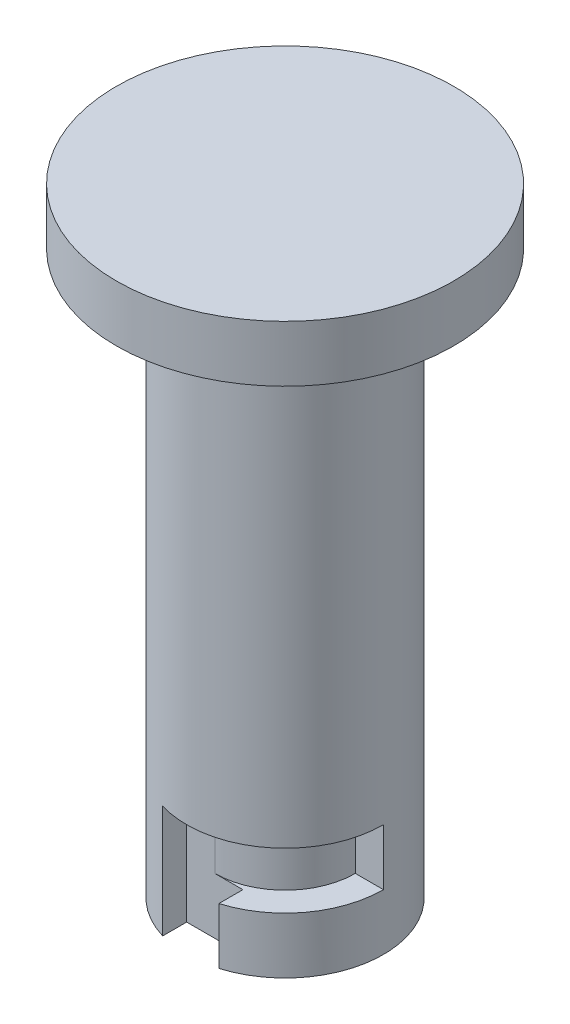
ISO-10303-21;
HEADER;
FILE_DESCRIPTION(('STEP AP214'),'2;1');
FILE_NAME('part.step','',(''),(''),'','','');
FILE_SCHEMA(('AUTOMOTIVE_DESIGN { 1 0 10303 214 1 1 1 1 }'));
ENDSEC;
DATA;
#1=APPLICATION_CONTEXT('core data for automotive mechanical design processes');
#2=APPLICATION_PROTOCOL_DEFINITION('international standard','automotive_design',2000,#1);
#3=PRODUCT_CONTEXT('',#1,'mechanical');
#4=PRODUCT('Part','Part','',(#3));
#5=PRODUCT_RELATED_PRODUCT_CATEGORY('part','',(#4));
#6=PRODUCT_DEFINITION_FORMATION('','',#4);
#7=PRODUCT_DEFINITION_CONTEXT('part definition',#1,'design');
#8=PRODUCT_DEFINITION('design','',#6,#7);
#9=PRODUCT_DEFINITION_SHAPE('','',#8);
#10=(LENGTH_UNIT() NAMED_UNIT(*) SI_UNIT(.MILLI.,.METRE.));
#11=(NAMED_UNIT(*) PLANE_ANGLE_UNIT() SI_UNIT($,.RADIAN.));
#12=(NAMED_UNIT(*) SI_UNIT($,.STERADIAN.) SOLID_ANGLE_UNIT());
#13=UNCERTAINTY_MEASURE_WITH_UNIT(LENGTH_MEASURE(1.E-05),#10,'distance_accuracy_value','');
#14=(GEOMETRIC_REPRESENTATION_CONTEXT(3) GLOBAL_UNCERTAINTY_ASSIGNED_CONTEXT((#13)) GLOBAL_UNIT_ASSIGNED_CONTEXT((#10,
#11,#12)) REPRESENTATION_CONTEXT('',''));
#15=CARTESIAN_POINT('',(0.,0.,0.));
#16=DIRECTION('',(0.,0.,1.));
#17=DIRECTION('',(1.,0.,0.));
#18=AXIS2_PLACEMENT_3D('',#15,#16,#17);
#19=CARTESIAN_POINT('',(0.,20.,0.));
#20=DIRECTION('',(0.,-1.,0.));
#21=DIRECTION('',(0.,0.,-1.));
#22=AXIS2_PLACEMENT_3D('',#19,#20,#21);
#23=CYLINDRICAL_SURFACE('',#22,3.5);
#24=CARTESIAN_POINT('',(0.,20.,0.));
#25=DIRECTION('',(0.,1.,0.));
#26=DIRECTION('',(0.,0.,1.));
#27=AXIS2_PLACEMENT_3D('',#24,#25,#26);
#28=CIRCLE('',#27,3.5);
#29=CARTESIAN_POINT('',(0.,20.,3.5));
#30=VERTEX_POINT('',#29);
#31=EDGE_CURVE('E190',#30,#30,#28,.T.);
#32=ORIENTED_EDGE('',*,*,#31,.F.);
#33=EDGE_LOOP('',(#32));
#34=FACE_BOUND('',#33,.T.);
#35=DIRECTION('',(0.,1.,0.));
#36=VECTOR('',#35,1.);
#37=CARTESIAN_POINT('',(-3.5,4.,0.));
#38=LINE('',#37,#36);
#39=CARTESIAN_POINT('',(-3.5,2.,0.));
#40=VERTEX_POINT('',#39);
#41=CARTESIAN_POINT('',(-3.5,4.,0.));
#42=VERTEX_POINT('',#41);
#43=EDGE_CURVE('E385',#40,#42,#38,.T.);
#44=ORIENTED_EDGE('',*,*,#43,.F.);
#45=CARTESIAN_POINT('',(0.,2.,0.));
#46=DIRECTION('',(0.,-1.,0.));
#47=DIRECTION('',(0.,0.,-1.));
#48=AXIS2_PLACEMENT_3D('',#45,#46,#47);
#49=CIRCLE('',#48,3.5);
#50=CARTESIAN_POINT('',(-0.999999999999999,2.,-3.35410196624968));
#51=VERTEX_POINT('',#50);
#52=EDGE_CURVE('E141',#40,#51,#49,.T.);
#53=ORIENTED_EDGE('',*,*,#52,.T.);
#54=DIRECTION('',(0.,-1.,0.));
#55=VECTOR('',#54,1.);
#56=CARTESIAN_POINT('',(-0.999999999999999,20.,-3.35410196624968));
#57=LINE('',#56,#55);
#58=CARTESIAN_POINT('',(-0.999999999999999,0.,-3.35410196624968));
#59=VERTEX_POINT('',#58);
#60=EDGE_CURVE('E175',#51,#59,#57,.T.);
#61=ORIENTED_EDGE('',*,*,#60,.T.);
#62=CARTESIAN_POINT('',(0.,0.,0.));
#63=DIRECTION('',(0.,1.,0.));
#64=DIRECTION('',(0.,0.,1.));
#65=AXIS2_PLACEMENT_3D('',#62,#63,#64);
#66=CIRCLE('',#65,3.5);
#67=CARTESIAN_POINT('',(-1.,0.,3.35410196624968));
#68=VERTEX_POINT('',#67);
#69=EDGE_CURVE('E187',#59,#68,#66,.T.);
#70=ORIENTED_EDGE('',*,*,#69,.T.);
#71=DIRECTION('',(0.,-1.,0.));
#72=VECTOR('',#71,1.);
#73=CARTESIAN_POINT('',(-1.,20.,3.35410196624968));
#74=LINE('',#73,#72);
#75=CARTESIAN_POINT('',(-1.,4.,3.35410196624968));
#76=VERTEX_POINT('',#75);
#77=EDGE_CURVE('E178',#68,#76,#74,.F.);
#78=ORIENTED_EDGE('',*,*,#77,.T.);
#79=CARTESIAN_POINT('',(0.,4.,0.));
#80=DIRECTION('',(0.,-1.,0.));
#81=DIRECTION('',(0.,0.,-1.));
#82=AXIS2_PLACEMENT_3D('',#79,#80,#81);
#83=CIRCLE('',#82,3.5);
#84=CARTESIAN_POINT('',(3.5,4.,0.));
#85=VERTEX_POINT('',#84);
#86=EDGE_CURVE('E204',#85,#76,#83,.T.);
#87=ORIENTED_EDGE('',*,*,#86,.F.);
#88=DIRECTION('',(0.,-1.,0.));
#89=VECTOR('',#88,1.);
#90=CARTESIAN_POINT('',(3.5,4.,0.));
#91=LINE('',#90,#89);
#92=CARTESIAN_POINT('',(3.5,2.,0.));
#93=VERTEX_POINT('',#92);
#94=EDGE_CURVE('E254',#85,#93,#91,.T.);
#95=ORIENTED_EDGE('',*,*,#94,.T.);
#96=CARTESIAN_POINT('',(0.,2.,0.));
#97=DIRECTION('',(0.,-1.,0.));
#98=DIRECTION('',(0.,0.,-1.));
#99=AXIS2_PLACEMENT_3D('',#96,#97,#98);
#100=CIRCLE('',#99,3.5);
#101=CARTESIAN_POINT('',(1.,2.,3.35410196624968));
#102=VERTEX_POINT('',#101);
#103=EDGE_CURVE('E260',#93,#102,#100,.T.);
#104=ORIENTED_EDGE('',*,*,#103,.T.);
#105=DIRECTION('',(0.,-1.,0.));
#106=VECTOR('',#105,1.);
#107=CARTESIAN_POINT('',(1.,20.,3.35410196624968));
#108=LINE('',#107,#106);
#109=CARTESIAN_POINT('',(1.,0.,3.35410196624968));
#110=VERTEX_POINT('',#109);
#111=EDGE_CURVE('E181',#102,#110,#108,.T.);
#112=ORIENTED_EDGE('',*,*,#111,.T.);
#113=CARTESIAN_POINT('',(1.,0.,-3.35410196624968));
#114=VERTEX_POINT('',#113);
#115=EDGE_CURVE('E194',#110,#114,#66,.T.);
#116=ORIENTED_EDGE('',*,*,#115,.T.);
#117=DIRECTION('',(0.,-1.,0.));
#118=VECTOR('',#117,1.);
#119=CARTESIAN_POINT('',(1.,20.,-3.35410196624968));
#120=LINE('',#119,#118);
#121=CARTESIAN_POINT('',(1.,4.,-3.35410196624968));
#122=VERTEX_POINT('',#121);
#123=EDGE_CURVE('E172',#114,#122,#120,.F.);
#124=ORIENTED_EDGE('',*,*,#123,.T.);
#125=CARTESIAN_POINT('',(0.,4.,0.));
#126=DIRECTION('',(0.,1.,0.));
#127=DIRECTION('',(0.,0.,1.));
#128=AXIS2_PLACEMENT_3D('',#125,#126,#127);
#129=CIRCLE('',#128,3.5);
#130=EDGE_CURVE('E202',#122,#42,#129,.T.);
#131=ORIENTED_EDGE('',*,*,#130,.T.);
#132=EDGE_LOOP('',(#44,#53,#61,#70,#78,#87,#95,#104,#112,#116,#124,#131));
#133=FACE_BOUND('',#132,.T.);
#134=ADVANCED_FACE('F33',(#34,#133),#23,.T.);
#135=CARTESIAN_POINT('',(1.,4.,2.5));
#136=DIRECTION('',(1.,0.,0.));
#137=DIRECTION('',(0.,0.,-1.));
#138=AXIS2_PLACEMENT_3D('',#135,#136,#137);
#139=PLANE('',#138);
#140=DIRECTION('',(0.,0.,1.));
#141=VECTOR('',#140,1.);
#142=CARTESIAN_POINT('',(1.,2.,2.5));
#143=LINE('',#142,#141);
#144=CARTESIAN_POINT('',(1.,2.,2.5));
#145=VERTEX_POINT('',#144);
#146=EDGE_CURVE('E209',#145,#102,#143,.T.);
#147=ORIENTED_EDGE('',*,*,#146,.F.);
#148=DIRECTION('',(0.,-1.,0.));
#149=VECTOR('',#148,1.);
#150=CARTESIAN_POINT('',(1.,4.,2.5));
#151=LINE('',#150,#149);
#152=CARTESIAN_POINT('',(1.,0.,2.5));
#153=VERTEX_POINT('',#152);
#154=EDGE_CURVE('E176',#145,#153,#151,.T.);
#155=ORIENTED_EDGE('',*,*,#154,.T.);
#156=DIRECTION('',(0.,0.,1.));
#157=VECTOR('',#156,1.);
#158=CARTESIAN_POINT('',(1.,0.,2.5));
#159=LINE('',#158,#157);
#160=EDGE_CURVE('E164',#153,#110,#159,.T.);
#161=ORIENTED_EDGE('',*,*,#160,.T.);
#162=ORIENTED_EDGE('',*,*,#111,.F.);
#163=EDGE_LOOP('',(#147,#155,#161,#162));
#164=FACE_BOUND('',#163,.T.);
#165=ADVANCED_FACE('F217',(#164),#139,.F.);
#166=CARTESIAN_POINT('',(-1.,4.,2.5));
#167=DIRECTION('',(0.,0.,-1.));
#168=DIRECTION('',(-1.,0.,0.));
#169=AXIS2_PLACEMENT_3D('',#166,#167,#168);
#170=PLANE('',#169);
#171=DIRECTION('',(1.,0.,0.));
#172=VECTOR('',#171,1.);
#173=CARTESIAN_POINT('',(-1.,2.,2.5));
#174=LINE('',#173,#172);
#175=CARTESIAN_POINT('',(0.,2.,2.5));
#176=VERTEX_POINT('',#175);
#177=EDGE_CURVE('E40',#176,#145,#174,.T.);
#178=ORIENTED_EDGE('',*,*,#177,.F.);
#179=DIRECTION('',(0.,1.,0.));
#180=VECTOR('',#179,1.);
#181=CARTESIAN_POINT('',(0.,4.,2.5));
#182=LINE('',#181,#180);
#183=CARTESIAN_POINT('',(0.,4.,2.5));
#184=VERTEX_POINT('',#183);
#185=EDGE_CURVE('E140',#176,#184,#182,.T.);
#186=ORIENTED_EDGE('',*,*,#185,.T.);
#187=DIRECTION('',(1.,0.,0.));
#188=VECTOR('',#187,1.);
#189=CARTESIAN_POINT('',(-1.,4.,2.5));
#190=LINE('',#189,#188);
#191=CARTESIAN_POINT('',(-1.,4.,2.5));
#192=VERTEX_POINT('',#191);
#193=EDGE_CURVE('E227',#192,#184,#190,.T.);
#194=ORIENTED_EDGE('',*,*,#193,.F.);
#195=DIRECTION('',(0.,-1.,0.));
#196=VECTOR('',#195,1.);
#197=CARTESIAN_POINT('',(-1.,4.,2.5));
#198=LINE('',#197,#196);
#199=CARTESIAN_POINT('',(-1.,0.,2.5));
#200=VERTEX_POINT('',#199);
#201=EDGE_CURVE('E225',#192,#200,#198,.T.);
#202=ORIENTED_EDGE('',*,*,#201,.T.);
#203=DIRECTION('',(1.,0.,0.));
#204=VECTOR('',#203,1.);
#205=CARTESIAN_POINT('',(-1.,0.,2.5));
#206=LINE('',#205,#204);
#207=EDGE_CURVE('E160',#200,#153,#206,.T.);
#208=ORIENTED_EDGE('',*,*,#207,.T.);
#209=ORIENTED_EDGE('',*,*,#154,.F.);
#210=EDGE_LOOP('',(#178,#186,#194,#202,#208,#209));
#211=FACE_BOUND('',#210,.T.);
#212=ADVANCED_FACE('F221',(#211),#170,.F.);
#213=CARTESIAN_POINT('',(0.,0.,0.));
#214=DIRECTION('',(0.,1.,0.));
#215=DIRECTION('',(0.,0.,1.));
#216=AXIS2_PLACEMENT_3D('',#213,#214,#215);
#217=PLANE('',#216);
#218=ORIENTED_EDGE('',*,*,#115,.F.);
#219=ORIENTED_EDGE('',*,*,#160,.F.);
#220=ORIENTED_EDGE('',*,*,#207,.F.);
#221=DIRECTION('',(0.,0.,1.));
#222=VECTOR('',#221,1.);
#223=CARTESIAN_POINT('',(-0.999999999999999,0.,0.));
#224=LINE('',#223,#222);
#225=EDGE_CURVE('E199',#200,#68,#224,.T.);
#226=ORIENTED_EDGE('',*,*,#225,.T.);
#227=ORIENTED_EDGE('',*,*,#69,.F.);
#228=DIRECTION('',(0.,0.,-1.));
#229=VECTOR('',#228,1.);
#230=CARTESIAN_POINT('',(-0.999999999999999,0.,-3.5));
#231=LINE('',#230,#229);
#232=CARTESIAN_POINT('',(-0.999999999999999,0.,-2.5));
#233=VERTEX_POINT('',#232);
#234=EDGE_CURVE('E169',#233,#59,#231,.T.);
#235=ORIENTED_EDGE('',*,*,#234,.F.);
#236=DIRECTION('',(-1.,0.,0.));
#237=VECTOR('',#236,1.);
#238=CARTESIAN_POINT('',(-0.999999999999999,0.,-2.5));
#239=LINE('',#238,#237);
#240=CARTESIAN_POINT('',(1.,0.,-2.5));
#241=VERTEX_POINT('',#240);
#242=EDGE_CURVE('E156',#241,#233,#239,.T.);
#243=ORIENTED_EDGE('',*,*,#242,.F.);
#244=DIRECTION('',(0.,0.,-1.));
#245=VECTOR('',#244,1.);
#246=CARTESIAN_POINT('',(1.,0.,0.));
#247=LINE('',#246,#245);
#248=EDGE_CURVE('E193',#241,#114,#247,.T.);
#249=ORIENTED_EDGE('',*,*,#248,.T.);
#250=EDGE_LOOP('',(#218,#219,#220,#226,#227,#235,#243,#249));
#251=FACE_BOUND('',#250,.T.);
#252=ADVANCED_FACE('F297',(#251),#217,.F.);
#253=CARTESIAN_POINT('',(0.,22.,0.));
#254=DIRECTION('',(0.,-1.,0.));
#255=DIRECTION('',(0.,0.,-1.));
#256=AXIS2_PLACEMENT_3D('',#253,#254,#255);
#257=CYLINDRICAL_SURFACE('',#256,6.);
#258=CARTESIAN_POINT('',(0.,22.,0.));
#259=DIRECTION('',(0.,1.,0.));
#260=DIRECTION('',(0.,0.,1.));
#261=AXIS2_PLACEMENT_3D('',#258,#259,#260);
#262=CIRCLE('',#261,6.);
#263=CARTESIAN_POINT('',(0.,22.,6.));
#264=VERTEX_POINT('',#263);
#265=EDGE_CURVE('E184',#264,#264,#262,.T.);
#266=ORIENTED_EDGE('',*,*,#265,.F.);
#267=EDGE_LOOP('',(#266));
#268=FACE_BOUND('',#267,.T.);
#269=CARTESIAN_POINT('',(0.,20.,0.));
#270=DIRECTION('',(0.,1.,0.));
#271=DIRECTION('',(0.,0.,1.));
#272=AXIS2_PLACEMENT_3D('',#269,#270,#271);
#273=CIRCLE('',#272,6.);
#274=CARTESIAN_POINT('',(0.,20.,6.));
#275=VERTEX_POINT('',#274);
#276=EDGE_CURVE('E183',#275,#275,#273,.T.);
#277=ORIENTED_EDGE('',*,*,#276,.T.);
#278=EDGE_LOOP('',(#277));
#279=FACE_BOUND('',#278,.T.);
#280=ADVANCED_FACE('F295',(#268,#279),#257,.T.);
#281=CARTESIAN_POINT('',(0.,22.,0.));
#282=DIRECTION('',(0.,1.,0.));
#283=DIRECTION('',(0.,0.,1.));
#284=AXIS2_PLACEMENT_3D('',#281,#282,#283);
#285=PLANE('',#284);
#286=ORIENTED_EDGE('',*,*,#265,.T.);
#287=EDGE_LOOP('',(#286));
#288=FACE_BOUND('',#287,.T.);
#289=ADVANCED_FACE('F291',(#288),#285,.T.);
#290=CARTESIAN_POINT('',(0.,20.,0.));
#291=DIRECTION('',(0.,1.,0.));
#292=DIRECTION('',(0.,0.,1.));
#293=AXIS2_PLACEMENT_3D('',#290,#291,#292);
#294=PLANE('',#293);
#295=ORIENTED_EDGE('',*,*,#31,.T.);
#296=EDGE_LOOP('',(#295));
#297=FACE_BOUND('',#296,.T.);
#298=ORIENTED_EDGE('',*,*,#276,.F.);
#299=EDGE_LOOP('',(#298));
#300=FACE_BOUND('',#299,.T.);
#301=ADVANCED_FACE('F287',(#297,#300),#294,.F.);
#302=CARTESIAN_POINT('',(0.,4.,0.));
#303=DIRECTION('',(0.,1.,0.));
#304=DIRECTION('',(0.,0.,1.));
#305=AXIS2_PLACEMENT_3D('',#302,#303,#304);
#306=PLANE('',#305);
#307=DIRECTION('',(-1.,0.,0.));
#308=VECTOR('',#307,1.);
#309=CARTESIAN_POINT('',(-0.999999999999999,4.,-2.5));
#310=LINE('',#309,#308);
#311=CARTESIAN_POINT('',(1.,4.,-2.5));
#312=VERTEX_POINT('',#311);
#313=CARTESIAN_POINT('',(0.,4.,-2.5));
#314=VERTEX_POINT('',#313);
#315=EDGE_CURVE('E166',#312,#314,#310,.T.);
#316=ORIENTED_EDGE('',*,*,#315,.T.);
#317=CARTESIAN_POINT('',(0.,4.,0.));
#318=DIRECTION('',(0.,-1.,0.));
#319=DIRECTION('',(0.,0.,-1.));
#320=AXIS2_PLACEMENT_3D('',#317,#318,#319);
#321=CIRCLE('',#320,2.5);
#322=CARTESIAN_POINT('',(-2.5,4.,0.));
#323=VERTEX_POINT('',#322);
#324=EDGE_CURVE('E47',#323,#314,#321,.T.);
#325=ORIENTED_EDGE('',*,*,#324,.F.);
#326=DIRECTION('',(1.,0.,0.));
#327=VECTOR('',#326,1.);
#328=CARTESIAN_POINT('',(-2.5,4.,0.));
#329=LINE('',#328,#327);
#330=EDGE_CURVE('E383',#42,#323,#329,.T.);
#331=ORIENTED_EDGE('',*,*,#330,.F.);
#332=ORIENTED_EDGE('',*,*,#130,.F.);
#333=DIRECTION('',(0.,0.,1.));
#334=VECTOR('',#333,1.);
#335=CARTESIAN_POINT('',(1.,4.,-2.5));
#336=LINE('',#335,#334);
#337=EDGE_CURVE('E231',#122,#312,#336,.T.);
#338=ORIENTED_EDGE('',*,*,#337,.T.);
#339=EDGE_LOOP('',(#316,#325,#331,#332,#338));
#340=FACE_BOUND('',#339,.T.);
#341=ADVANCED_FACE('F290',(#340),#306,.F.);
#342=CARTESIAN_POINT('',(-0.999999999999999,4.,-3.5));
#343=DIRECTION('',(-1.,0.,0.));
#344=DIRECTION('',(0.,0.,1.));
#345=AXIS2_PLACEMENT_3D('',#342,#343,#344);
#346=PLANE('',#345);
#347=ORIENTED_EDGE('',*,*,#60,.F.);
#348=DIRECTION('',(0.,0.,1.));
#349=VECTOR('',#348,1.);
#350=CARTESIAN_POINT('',(-0.999999999999999,2.,-3.5));
#351=LINE('',#350,#349);
#352=CARTESIAN_POINT('',(-0.999999999999999,2.,-2.5));
#353=VERTEX_POINT('',#352);
#354=EDGE_CURVE('E219',#51,#353,#351,.T.);
#355=ORIENTED_EDGE('',*,*,#354,.T.);
#356=DIRECTION('',(0.,-1.,0.));
#357=VECTOR('',#356,1.);
#358=CARTESIAN_POINT('',(-0.999999999999999,4.,-2.5));
#359=LINE('',#358,#357);
#360=EDGE_CURVE('E153',#353,#233,#359,.T.);
#361=ORIENTED_EDGE('',*,*,#360,.T.);
#362=ORIENTED_EDGE('',*,*,#234,.T.);
#363=EDGE_LOOP('',(#347,#355,#361,#362));
#364=FACE_BOUND('',#363,.T.);
#365=ADVANCED_FACE('F312',(#364),#346,.F.);
#366=CARTESIAN_POINT('',(1.,4.,-2.5));
#367=DIRECTION('',(1.,0.,0.));
#368=DIRECTION('',(0.,0.,-1.));
#369=AXIS2_PLACEMENT_3D('',#366,#367,#368);
#370=PLANE('',#369);
#371=ORIENTED_EDGE('',*,*,#248,.F.);
#372=DIRECTION('',(0.,-1.,0.));
#373=VECTOR('',#372,1.);
#374=CARTESIAN_POINT('',(1.,4.,-2.5));
#375=LINE('',#374,#373);
#376=EDGE_CURVE('E161',#312,#241,#375,.T.);
#377=ORIENTED_EDGE('',*,*,#376,.F.);
#378=ORIENTED_EDGE('',*,*,#337,.F.);
#379=ORIENTED_EDGE('',*,*,#123,.F.);
#380=EDGE_LOOP('',(#371,#377,#378,#379));
#381=FACE_BOUND('',#380,.T.);
#382=ADVANCED_FACE('F309',(#381),#370,.F.);
#383=CARTESIAN_POINT('',(-0.999999999999999,4.,-2.5));
#384=DIRECTION('',(0.,0.,1.));
#385=DIRECTION('',(1.,0.,0.));
#386=AXIS2_PLACEMENT_3D('',#383,#384,#385);
#387=PLANE('',#386);
#388=ORIENTED_EDGE('',*,*,#360,.F.);
#389=DIRECTION('',(1.,0.,0.));
#390=VECTOR('',#389,1.);
#391=CARTESIAN_POINT('',(-0.999999999999999,2.,-2.5));
#392=LINE('',#391,#390);
#393=CARTESIAN_POINT('',(0.,2.,-2.5));
#394=VERTEX_POINT('',#393);
#395=EDGE_CURVE('E11',#353,#394,#392,.T.);
#396=ORIENTED_EDGE('',*,*,#395,.T.);
#397=DIRECTION('',(0.,-1.,0.));
#398=VECTOR('',#397,1.);
#399=CARTESIAN_POINT('',(0.,4.,-2.5));
#400=LINE('',#399,#398);
#401=EDGE_CURVE('E143',#314,#394,#400,.T.);
#402=ORIENTED_EDGE('',*,*,#401,.F.);
#403=ORIENTED_EDGE('',*,*,#315,.F.);
#404=ORIENTED_EDGE('',*,*,#376,.T.);
#405=ORIENTED_EDGE('',*,*,#242,.T.);
#406=EDGE_LOOP('',(#388,#396,#402,#403,#404,#405));
#407=FACE_BOUND('',#406,.T.);
#408=ADVANCED_FACE('F151',(#407),#387,.F.);
#409=CARTESIAN_POINT('',(0.,4.,0.));
#410=DIRECTION('',(0.,-1.,0.));
#411=DIRECTION('',(0.,0.,-1.));
#412=AXIS2_PLACEMENT_3D('',#409,#410,#411);
#413=PLANE('',#412);
#414=ORIENTED_EDGE('',*,*,#193,.T.);
#415=CARTESIAN_POINT('',(0.,4.,0.));
#416=DIRECTION('',(0.,-1.,0.));
#417=DIRECTION('',(0.,0.,-1.));
#418=AXIS2_PLACEMENT_3D('',#415,#416,#417);
#419=CIRCLE('',#418,2.5);
#420=CARTESIAN_POINT('',(2.5,4.,0.));
#421=VERTEX_POINT('',#420);
#422=EDGE_CURVE('E55',#421,#184,#419,.T.);
#423=ORIENTED_EDGE('',*,*,#422,.F.);
#424=DIRECTION('',(1.,0.,0.));
#425=VECTOR('',#424,1.);
#426=CARTESIAN_POINT('',(2.5,4.,0.));
#427=LINE('',#426,#425);
#428=EDGE_CURVE('E249',#421,#85,#427,.T.);
#429=ORIENTED_EDGE('',*,*,#428,.T.);
#430=ORIENTED_EDGE('',*,*,#86,.T.);
#431=DIRECTION('',(0.,0.,-1.));
#432=VECTOR('',#431,1.);
#433=CARTESIAN_POINT('',(-1.,4.,3.5));
#434=LINE('',#433,#432);
#435=EDGE_CURVE('E237',#76,#192,#434,.T.);
#436=ORIENTED_EDGE('',*,*,#435,.T.);
#437=EDGE_LOOP('',(#414,#423,#429,#430,#436));
#438=FACE_BOUND('',#437,.T.);
#439=ADVANCED_FACE('F242',(#438),#413,.T.);
#440=CARTESIAN_POINT('',(-1.,4.,3.5));
#441=DIRECTION('',(-1.,0.,0.));
#442=DIRECTION('',(0.,0.,1.));
#443=AXIS2_PLACEMENT_3D('',#440,#441,#442);
#444=PLANE('',#443);
#445=ORIENTED_EDGE('',*,*,#225,.F.);
#446=ORIENTED_EDGE('',*,*,#201,.F.);
#447=ORIENTED_EDGE('',*,*,#435,.F.);
#448=ORIENTED_EDGE('',*,*,#77,.F.);
#449=EDGE_LOOP('',(#445,#446,#447,#448));
#450=FACE_BOUND('',#449,.T.);
#451=ADVANCED_FACE('F277',(#450),#444,.F.);
#452=CARTESIAN_POINT('',(2.5,2.,0.));
#453=DIRECTION('',(0.,1.,0.));
#454=DIRECTION('',(0.,0.,1.));
#455=AXIS2_PLACEMENT_3D('',#452,#453,#454);
#456=PLANE('',#455);
#457=ORIENTED_EDGE('',*,*,#146,.T.);
#458=ORIENTED_EDGE('',*,*,#103,.F.);
#459=DIRECTION('',(-1.,0.,0.));
#460=VECTOR('',#459,1.);
#461=CARTESIAN_POINT('',(2.5,2.,0.));
#462=LINE('',#461,#460);
#463=CARTESIAN_POINT('',(2.5,2.,0.));
#464=VERTEX_POINT('',#463);
#465=EDGE_CURVE('E257',#93,#464,#462,.T.);
#466=ORIENTED_EDGE('',*,*,#465,.T.);
#467=CARTESIAN_POINT('',(0.,2.,0.));
#468=DIRECTION('',(0.,-1.,0.));
#469=DIRECTION('',(0.,0.,-1.));
#470=AXIS2_PLACEMENT_3D('',#467,#468,#469);
#471=CIRCLE('',#470,2.5);
#472=EDGE_CURVE('E212',#464,#176,#471,.T.);
#473=ORIENTED_EDGE('',*,*,#472,.T.);
#474=ORIENTED_EDGE('',*,*,#177,.T.);
#475=EDGE_LOOP('',(#457,#458,#466,#473,#474));
#476=FACE_BOUND('',#475,.T.);
#477=ADVANCED_FACE('F208',(#476),#456,.T.);
#478=CARTESIAN_POINT('',(0.,0.,0.));
#479=DIRECTION('',(0.,-1.,0.));
#480=DIRECTION('',(0.,0.,-1.));
#481=AXIS2_PLACEMENT_3D('',#478,#479,#480);
#482=CYLINDRICAL_SURFACE('',#481,2.5);
#483=ORIENTED_EDGE('',*,*,#472,.F.);
#484=DIRECTION('',(0.,1.,0.));
#485=VECTOR('',#484,1.);
#486=CARTESIAN_POINT('',(2.5,4.,0.));
#487=LINE('',#486,#485);
#488=EDGE_CURVE('E247',#464,#421,#487,.T.);
#489=ORIENTED_EDGE('',*,*,#488,.T.);
#490=ORIENTED_EDGE('',*,*,#422,.T.);
#491=ORIENTED_EDGE('',*,*,#185,.F.);
#492=EDGE_LOOP('',(#483,#489,#490,#491));
#493=FACE_BOUND('',#492,.T.);
#494=ADVANCED_FACE('F269',(#493),#482,.T.);
#495=CARTESIAN_POINT('',(0.,0.,0.));
#496=DIRECTION('',(0.,0.,1.));
#497=DIRECTION('',(1.,0.,0.));
#498=AXIS2_PLACEMENT_3D('',#495,#496,#497);
#499=PLANE('',#498);
#500=ORIENTED_EDGE('',*,*,#488,.F.);
#501=ORIENTED_EDGE('',*,*,#465,.F.);
#502=ORIENTED_EDGE('',*,*,#94,.F.);
#503=ORIENTED_EDGE('',*,*,#428,.F.);
#504=EDGE_LOOP('',(#500,#501,#502,#503));
#505=FACE_BOUND('',#504,.T.);
#506=ADVANCED_FACE('F268',(#505),#499,.T.);
#507=CARTESIAN_POINT('',(-2.5,2.,0.));
#508=DIRECTION('',(0.,-1.,0.));
#509=DIRECTION('',(0.,0.,-1.));
#510=AXIS2_PLACEMENT_3D('',#507,#508,#509);
#511=PLANE('',#510);
#512=ORIENTED_EDGE('',*,*,#52,.F.);
#513=DIRECTION('',(-1.,0.,0.));
#514=VECTOR('',#513,1.);
#515=CARTESIAN_POINT('',(-2.5,2.,0.));
#516=LINE('',#515,#514);
#517=CARTESIAN_POINT('',(-2.5,2.,0.));
#518=VERTEX_POINT('',#517);
#519=EDGE_CURVE('E138',#518,#40,#516,.T.);
#520=ORIENTED_EDGE('',*,*,#519,.F.);
#521=CARTESIAN_POINT('',(0.,2.,0.));
#522=DIRECTION('',(0.,-1.,0.));
#523=DIRECTION('',(0.,0.,-1.));
#524=AXIS2_PLACEMENT_3D('',#521,#522,#523);
#525=CIRCLE('',#524,2.5);
#526=EDGE_CURVE('E134',#518,#394,#525,.T.);
#527=ORIENTED_EDGE('',*,*,#526,.T.);
#528=ORIENTED_EDGE('',*,*,#395,.F.);
#529=ORIENTED_EDGE('',*,*,#354,.F.);
#530=EDGE_LOOP('',(#512,#520,#527,#528,#529));
#531=FACE_BOUND('',#530,.T.);
#532=ADVANCED_FACE('F135',(#531),#511,.F.);
#533=CARTESIAN_POINT('',(0.,0.,0.));
#534=DIRECTION('',(0.,-1.,0.));
#535=DIRECTION('',(0.,0.,-1.));
#536=AXIS2_PLACEMENT_3D('',#533,#534,#535);
#537=CYLINDRICAL_SURFACE('',#536,2.5);
#538=ORIENTED_EDGE('',*,*,#526,.F.);
#539=DIRECTION('',(0.,-1.,0.));
#540=VECTOR('',#539,1.);
#541=CARTESIAN_POINT('',(-2.5,4.,0.));
#542=LINE('',#541,#540);
#543=EDGE_CURVE('E148',#323,#518,#542,.T.);
#544=ORIENTED_EDGE('',*,*,#543,.F.);
#545=ORIENTED_EDGE('',*,*,#324,.T.);
#546=ORIENTED_EDGE('',*,*,#401,.T.);
#547=EDGE_LOOP('',(#538,#544,#545,#546));
#548=FACE_BOUND('',#547,.T.);
#549=ADVANCED_FACE('F144',(#548),#537,.T.);
#550=CARTESIAN_POINT('',(0.,0.,0.));
#551=DIRECTION('',(0.,0.,-1.));
#552=DIRECTION('',(-1.,0.,0.));
#553=AXIS2_PLACEMENT_3D('',#550,#551,#552);
#554=PLANE('',#553);
#555=ORIENTED_EDGE('',*,*,#543,.T.);
#556=ORIENTED_EDGE('',*,*,#519,.T.);
#557=ORIENTED_EDGE('',*,*,#43,.T.);
#558=ORIENTED_EDGE('',*,*,#330,.T.);
#559=EDGE_LOOP('',(#555,#556,#557,#558));
#560=FACE_BOUND('',#559,.T.);
#561=ADVANCED_FACE('F367',(#560),#554,.T.);
#562=CLOSED_SHELL('',(#134,#165,#212,#252,#280,#289,#301,#341,#365,#382,#408,#439,#451,#477,
#494,#506,#532,#549,#561));
#563=MANIFOLD_SOLID_BREP('B2',#562);
#564=ADVANCED_BREP_SHAPE_REPRESENTATION('',(#18,#563),#14);
#565=SHAPE_DEFINITION_REPRESENTATION(#9,#564);
ENDSEC;
END-ISO-10303-21;
